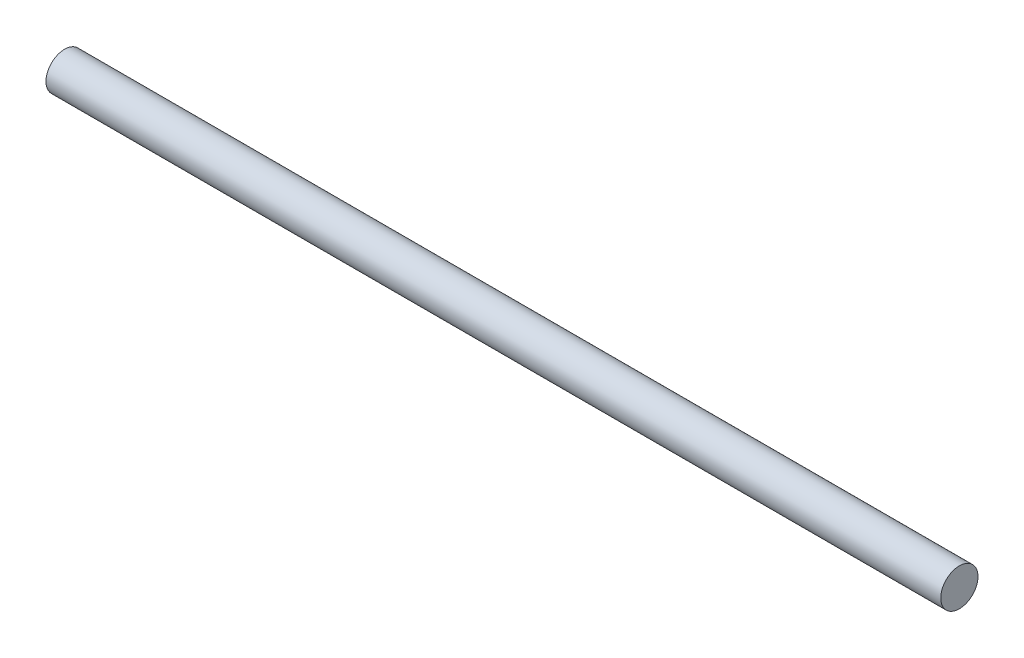
ISO-10303-21;
HEADER;
FILE_DESCRIPTION(('STEP AP214'),'2;1');
FILE_NAME('part.step','',(''),(''),'','','');
FILE_SCHEMA(('AUTOMOTIVE_DESIGN { 1 0 10303 214 1 1 1 1 }'));
ENDSEC;
DATA;
#1=APPLICATION_CONTEXT('core data for automotive mechanical design processes');
#2=APPLICATION_PROTOCOL_DEFINITION('international standard','automotive_design',2000,#1);
#3=PRODUCT_CONTEXT('',#1,'mechanical');
#4=PRODUCT('Part','Part','',(#3));
#5=PRODUCT_RELATED_PRODUCT_CATEGORY('part','',(#4));
#6=PRODUCT_DEFINITION_FORMATION('','',#4);
#7=PRODUCT_DEFINITION_CONTEXT('part definition',#1,'design');
#8=PRODUCT_DEFINITION('design','',#6,#7);
#9=PRODUCT_DEFINITION_SHAPE('','',#8);
#10=(LENGTH_UNIT() NAMED_UNIT(*) SI_UNIT(.MILLI.,.METRE.));
#11=(NAMED_UNIT(*) PLANE_ANGLE_UNIT() SI_UNIT($,.RADIAN.));
#12=(NAMED_UNIT(*) SI_UNIT($,.STERADIAN.) SOLID_ANGLE_UNIT());
#13=UNCERTAINTY_MEASURE_WITH_UNIT(LENGTH_MEASURE(1.E-05),#10,'distance_accuracy_value','');
#14=(GEOMETRIC_REPRESENTATION_CONTEXT(3) GLOBAL_UNCERTAINTY_ASSIGNED_CONTEXT((#13)) GLOBAL_UNIT_ASSIGNED_CONTEXT((#10,
#11,#12)) REPRESENTATION_CONTEXT('',''));
#15=CARTESIAN_POINT('',(0.,0.,0.));
#16=DIRECTION('',(0.,0.,1.));
#17=DIRECTION('',(1.,0.,0.));
#18=AXIS2_PLACEMENT_3D('',#15,#16,#17);
#19=CARTESIAN_POINT('',(152.4,0.,0.));
#20=DIRECTION('',(-1.,0.,0.));
#21=DIRECTION('',(0.,0.,1.));
#22=AXIS2_PLACEMENT_3D('',#19,#20,#21);
#23=CYLINDRICAL_SURFACE('',#22,3.175);
#24=CARTESIAN_POINT('',(152.4,0.,0.));
#25=DIRECTION('',(1.,0.,0.));
#26=DIRECTION('',(0.,0.,-1.));
#27=AXIS2_PLACEMENT_3D('',#24,#25,#26);
#28=CIRCLE('',#27,3.175);
#29=CARTESIAN_POINT('',(152.4,0.,-3.175));
#30=VERTEX_POINT('',#29);
#31=EDGE_CURVE('E10',#30,#30,#28,.T.);
#32=ORIENTED_EDGE('',*,*,#31,.F.);
#33=EDGE_LOOP('',(#32));
#34=FACE_BOUND('',#33,.T.);
#35=CARTESIAN_POINT('',(0.,0.,0.));
#36=DIRECTION('',(1.,0.,0.));
#37=DIRECTION('',(0.,0.,-1.));
#38=AXIS2_PLACEMENT_3D('',#35,#36,#37);
#39=CIRCLE('',#38,3.175);
#40=CARTESIAN_POINT('',(0.,0.,-3.175));
#41=VERTEX_POINT('',#40);
#42=EDGE_CURVE('E40',#41,#41,#39,.T.);
#43=ORIENTED_EDGE('',*,*,#42,.T.);
#44=EDGE_LOOP('',(#43));
#45=FACE_BOUND('',#44,.T.);
#46=ADVANCED_FACE('F37',(#34,#45),#23,.T.);
#47=CARTESIAN_POINT('',(152.4,0.,0.));
#48=DIRECTION('',(1.,0.,0.));
#49=DIRECTION('',(0.,0.,-1.));
#50=AXIS2_PLACEMENT_3D('',#47,#48,#49);
#51=PLANE('',#50);
#52=ORIENTED_EDGE('',*,*,#31,.T.);
#53=EDGE_LOOP('',(#52));
#54=FACE_BOUND('',#53,.T.);
#55=ADVANCED_FACE('F54',(#54),#51,.T.);
#56=CARTESIAN_POINT('',(0.,0.,0.));
#57=DIRECTION('',(1.,0.,0.));
#58=DIRECTION('',(0.,0.,-1.));
#59=AXIS2_PLACEMENT_3D('',#56,#57,#58);
#60=PLANE('',#59);
#61=ORIENTED_EDGE('',*,*,#42,.F.);
#62=EDGE_LOOP('',(#61));
#63=FACE_BOUND('',#62,.T.);
#64=ADVANCED_FACE('F52',(#63),#60,.F.);
#65=CLOSED_SHELL('',(#46,#55,#64));
#66=MANIFOLD_SOLID_BREP('B2',#65);
#67=ADVANCED_BREP_SHAPE_REPRESENTATION('',(#18,#66),#14);
#68=SHAPE_DEFINITION_REPRESENTATION(#9,#67);
ENDSEC;
END-ISO-10303-21;
